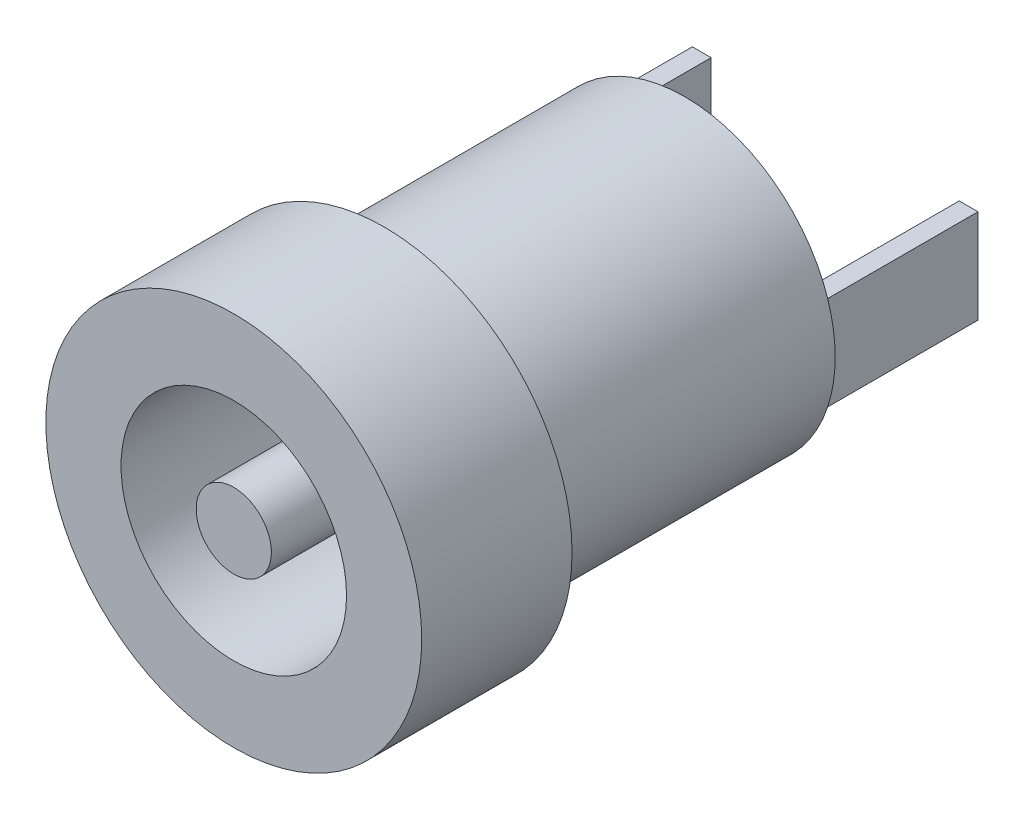
ISO-10303-21;
HEADER;
FILE_DESCRIPTION(('STEP AP214'),'2;1');
FILE_NAME('part.step','',(''),(''),'','','');
FILE_SCHEMA(('AUTOMOTIVE_DESIGN { 1 0 10303 214 1 1 1 1 }'));
ENDSEC;
DATA;
#1=APPLICATION_CONTEXT('core data for automotive mechanical design processes');
#2=APPLICATION_PROTOCOL_DEFINITION('international standard','automotive_design',2000,#1);
#3=PRODUCT_CONTEXT('',#1,'mechanical');
#4=PRODUCT('Part','Part','',(#3));
#5=PRODUCT_RELATED_PRODUCT_CATEGORY('part','',(#4));
#6=PRODUCT_DEFINITION_FORMATION('','',#4);
#7=PRODUCT_DEFINITION_CONTEXT('part definition',#1,'design');
#8=PRODUCT_DEFINITION('design','',#6,#7);
#9=PRODUCT_DEFINITION_SHAPE('','',#8);
#10=(LENGTH_UNIT() NAMED_UNIT(*) SI_UNIT(.MILLI.,.METRE.));
#11=(NAMED_UNIT(*) PLANE_ANGLE_UNIT() SI_UNIT($,.RADIAN.));
#12=(NAMED_UNIT(*) SI_UNIT($,.STERADIAN.) SOLID_ANGLE_UNIT());
#13=UNCERTAINTY_MEASURE_WITH_UNIT(LENGTH_MEASURE(1.E-05),#10,'distance_accuracy_value','');
#14=(GEOMETRIC_REPRESENTATION_CONTEXT(3) GLOBAL_UNCERTAINTY_ASSIGNED_CONTEXT((#13)) GLOBAL_UNIT_ASSIGNED_CONTEXT((#10,
#11,#12)) REPRESENTATION_CONTEXT('',''));
#15=CARTESIAN_POINT('',(0.,0.,0.));
#16=DIRECTION('',(0.,0.,1.));
#17=DIRECTION('',(1.,0.,0.));
#18=AXIS2_PLACEMENT_3D('',#15,#16,#17);
#19=CARTESIAN_POINT('',(0.,0.,-12.));
#20=DIRECTION('',(0.,0.,-1.));
#21=DIRECTION('',(-1.,0.,0.));
#22=AXIS2_PLACEMENT_3D('',#19,#20,#21);
#23=PLANE('',#22);
#24=DIRECTION('',(0.,-1.,0.));
#25=VECTOR('',#24,1.);
#26=CARTESIAN_POINT('',(-3.3,0.,-12.));
#27=LINE('',#26,#25);
#28=CARTESIAN_POINT('',(-3.3,1.24899959967968,-12.));
#29=VERTEX_POINT('',#28);
#30=CARTESIAN_POINT('',(-3.3,-1.24899959967968,-12.));
#31=VERTEX_POINT('',#30);
#32=EDGE_CURVE('E56',#29,#31,#27,.T.);
#33=ORIENTED_EDGE('',*,*,#32,.F.);
#34=DIRECTION('',(1.,0.,0.));
#35=VECTOR('',#34,1.);
#36=CARTESIAN_POINT('',(0.,1.24899959967968,-12.));
#37=LINE('',#36,#35);
#38=CARTESIAN_POINT('',(-3.8,1.24899959967968,-12.));
#39=VERTEX_POINT('',#38);
#40=EDGE_CURVE('E137',#39,#29,#37,.T.);
#41=ORIENTED_EDGE('',*,*,#40,.F.);
#42=CARTESIAN_POINT('',(0.,0.,-12.));
#43=DIRECTION('',(0.,0.,-1.));
#44=DIRECTION('',(-1.,0.,0.));
#45=AXIS2_PLACEMENT_3D('',#42,#43,#44);
#46=CIRCLE('',#45,4.);
#47=CARTESIAN_POINT('',(3.8,1.24899959967968,-12.));
#48=VERTEX_POINT('',#47);
#49=EDGE_CURVE('E179',#39,#48,#46,.T.);
#50=ORIENTED_EDGE('',*,*,#49,.T.);
#51=DIRECTION('',(-1.,0.,0.));
#52=VECTOR('',#51,1.);
#53=CARTESIAN_POINT('',(0.,1.24899959967968,-12.));
#54=LINE('',#53,#52);
#55=CARTESIAN_POINT('',(3.3,1.24899959967968,-12.));
#56=VERTEX_POINT('',#55);
#57=EDGE_CURVE('E158',#48,#56,#54,.T.);
#58=ORIENTED_EDGE('',*,*,#57,.T.);
#59=DIRECTION('',(0.,-1.,0.));
#60=VECTOR('',#59,1.);
#61=CARTESIAN_POINT('',(3.3,0.,-12.));
#62=LINE('',#61,#60);
#63=CARTESIAN_POINT('',(3.3,-1.24899959967968,-12.));
#64=VERTEX_POINT('',#63);
#65=EDGE_CURVE('E116',#56,#64,#62,.T.);
#66=ORIENTED_EDGE('',*,*,#65,.T.);
#67=DIRECTION('',(-1.,0.,0.));
#68=VECTOR('',#67,1.);
#69=CARTESIAN_POINT('',(0.,-1.24899959967968,-12.));
#70=LINE('',#69,#68);
#71=CARTESIAN_POINT('',(3.8,-1.24899959967968,-12.));
#72=VERTEX_POINT('',#71);
#73=EDGE_CURVE('E148',#72,#64,#70,.T.);
#74=ORIENTED_EDGE('',*,*,#73,.F.);
#75=CARTESIAN_POINT('',(-3.8,-1.24899959967968,-12.));
#76=VERTEX_POINT('',#75);
#77=EDGE_CURVE('E186',#72,#76,#46,.T.);
#78=ORIENTED_EDGE('',*,*,#77,.T.);
#79=DIRECTION('',(1.,0.,0.));
#80=VECTOR('',#79,1.);
#81=CARTESIAN_POINT('',(0.,-1.24899959967968,-12.));
#82=LINE('',#81,#80);
#83=EDGE_CURVE('E61',#76,#31,#82,.T.);
#84=ORIENTED_EDGE('',*,*,#83,.T.);
#85=EDGE_LOOP('',(#33,#41,#50,#58,#66,#74,#78,#84));
#86=FACE_BOUND('',#85,.T.);
#87=ADVANCED_FACE('F41',(#86),#23,.T.);
#88=DIRECTION('',(0.,-1.,0.));
#89=VECTOR('',#88,1.);
#90=CARTESIAN_POINT('',(-3.8,0.,-12.));
#91=LINE('',#90,#89);
#92=EDGE_CURVE('E114',#39,#76,#91,.T.);
#93=ORIENTED_EDGE('',*,*,#92,.T.);
#94=EDGE_CURVE('E241',#76,#39,#46,.T.);
#95=ORIENTED_EDGE('',*,*,#94,.T.);
#96=EDGE_LOOP('',(#93,#95));
#97=FACE_BOUND('',#96,.T.);
#98=ADVANCED_FACE('F209',(#97),#23,.T.);
#99=CARTESIAN_POINT('',(0.,0.,-4.));
#100=DIRECTION('',(0.,0.,1.));
#101=DIRECTION('',(1.,0.,0.));
#102=AXIS2_PLACEMENT_3D('',#99,#100,#101);
#103=CYLINDRICAL_SURFACE('',#102,3.);
#104=CARTESIAN_POINT('',(0.,0.,-4.));
#105=DIRECTION('',(0.,0.,1.));
#106=DIRECTION('',(1.,0.,0.));
#107=AXIS2_PLACEMENT_3D('',#104,#105,#106);
#108=CIRCLE('',#107,3.);
#109=CARTESIAN_POINT('',(3.,0.,-4.));
#110=VERTEX_POINT('',#109);
#111=EDGE_CURVE('E187',#110,#110,#108,.T.);
#112=ORIENTED_EDGE('',*,*,#111,.F.);
#113=EDGE_LOOP('',(#112));
#114=FACE_BOUND('',#113,.T.);
#115=CARTESIAN_POINT('',(0.,0.,0.));
#116=DIRECTION('',(0.,0.,1.));
#117=DIRECTION('',(1.,0.,0.));
#118=AXIS2_PLACEMENT_3D('',#115,#116,#117);
#119=CIRCLE('',#118,3.);
#120=CARTESIAN_POINT('',(3.,0.,0.));
#121=VERTEX_POINT('',#120);
#122=EDGE_CURVE('E185',#121,#121,#119,.T.);
#123=ORIENTED_EDGE('',*,*,#122,.T.);
#124=EDGE_LOOP('',(#123));
#125=FACE_BOUND('',#124,.T.);
#126=ADVANCED_FACE('F43',(#114,#125),#103,.F.);
#127=CARTESIAN_POINT('',(0.,0.,-4.));
#128=DIRECTION('',(0.,0.,1.));
#129=DIRECTION('',(1.,0.,0.));
#130=AXIS2_PLACEMENT_3D('',#127,#128,#129);
#131=CYLINDRICAL_SURFACE('',#130,5.);
#132=CARTESIAN_POINT('',(0.,0.,-4.));
#133=DIRECTION('',(0.,0.,1.));
#134=DIRECTION('',(1.,0.,0.));
#135=AXIS2_PLACEMENT_3D('',#132,#133,#134);
#136=CIRCLE('',#135,5.);
#137=CARTESIAN_POINT('',(5.,0.,-4.));
#138=VERTEX_POINT('',#137);
#139=EDGE_CURVE('E49',#138,#138,#136,.T.);
#140=ORIENTED_EDGE('',*,*,#139,.T.);
#141=EDGE_LOOP('',(#140));
#142=FACE_BOUND('',#141,.T.);
#143=CARTESIAN_POINT('',(0.,0.,0.));
#144=DIRECTION('',(0.,0.,1.));
#145=DIRECTION('',(1.,0.,0.));
#146=AXIS2_PLACEMENT_3D('',#143,#144,#145);
#147=CIRCLE('',#146,5.);
#148=CARTESIAN_POINT('',(5.,0.,0.));
#149=VERTEX_POINT('',#148);
#150=EDGE_CURVE('E190',#149,#149,#147,.T.);
#151=ORIENTED_EDGE('',*,*,#150,.F.);
#152=EDGE_LOOP('',(#151));
#153=FACE_BOUND('',#152,.T.);
#154=ADVANCED_FACE('F199',(#142,#153),#131,.T.);
#155=CARTESIAN_POINT('',(0.,0.,-4.));
#156=DIRECTION('',(0.,0.,1.));
#157=DIRECTION('',(1.,0.,0.));
#158=AXIS2_PLACEMENT_3D('',#155,#156,#157);
#159=PLANE('',#158);
#160=CARTESIAN_POINT('',(0.,0.,-4.));
#161=DIRECTION('',(0.,0.,1.));
#162=DIRECTION('',(1.,0.,0.));
#163=AXIS2_PLACEMENT_3D('',#160,#161,#162);
#164=CIRCLE('',#163,4.);
#165=CARTESIAN_POINT('',(4.,0.,-4.));
#166=VERTEX_POINT('',#165);
#167=EDGE_CURVE('E12',#166,#166,#164,.F.);
#168=ORIENTED_EDGE('',*,*,#167,.F.);
#169=EDGE_LOOP('',(#168));
#170=FACE_BOUND('',#169,.T.);
#171=ORIENTED_EDGE('',*,*,#139,.F.);
#172=EDGE_LOOP('',(#171));
#173=FACE_BOUND('',#172,.T.);
#174=ADVANCED_FACE('F201',(#170,#173),#159,.F.);
#175=CARTESIAN_POINT('',(0.,0.,0.));
#176=DIRECTION('',(0.,0.,1.));
#177=DIRECTION('',(1.,0.,0.));
#178=AXIS2_PLACEMENT_3D('',#175,#176,#177);
#179=PLANE('',#178);
#180=ORIENTED_EDGE('',*,*,#122,.F.);
#181=EDGE_LOOP('',(#180));
#182=FACE_BOUND('',#181,.T.);
#183=ORIENTED_EDGE('',*,*,#150,.T.);
#184=EDGE_LOOP('',(#183));
#185=FACE_BOUND('',#184,.T.);
#186=ADVANCED_FACE('F197',(#182,#185),#179,.T.);
#187=DIRECTION('',(0.,-1.,0.));
#188=VECTOR('',#187,1.);
#189=CARTESIAN_POINT('',(3.8,0.,-12.));
#190=LINE('',#189,#188);
#191=EDGE_CURVE('E161',#48,#72,#190,.T.);
#192=ORIENTED_EDGE('',*,*,#191,.F.);
#193=EDGE_CURVE('E182',#48,#72,#46,.T.);
#194=ORIENTED_EDGE('',*,*,#193,.T.);
#195=EDGE_LOOP('',(#192,#194));
#196=FACE_BOUND('',#195,.T.);
#197=ADVANCED_FACE('F214',(#196),#23,.T.);
#198=CARTESIAN_POINT('',(0.,0.,-12.));
#199=DIRECTION('',(0.,0.,1.));
#200=DIRECTION('',(1.,0.,0.));
#201=AXIS2_PLACEMENT_3D('',#198,#199,#200);
#202=CYLINDRICAL_SURFACE('',#201,4.);
#203=ORIENTED_EDGE('',*,*,#193,.F.);
#204=ORIENTED_EDGE('',*,*,#49,.F.);
#205=ORIENTED_EDGE('',*,*,#94,.F.);
#206=ORIENTED_EDGE('',*,*,#77,.F.);
#207=EDGE_LOOP('',(#203,#204,#205,#206));
#208=FACE_BOUND('',#207,.T.);
#209=ORIENTED_EDGE('',*,*,#167,.T.);
#210=EDGE_LOOP('',(#209));
#211=FACE_BOUND('',#210,.T.);
#212=ADVANCED_FACE('F222',(#208,#211),#202,.T.);
#213=CARTESIAN_POINT('',(0.,0.,-4.));
#214=DIRECTION('',(0.,0.,-1.));
#215=DIRECTION('',(-1.,0.,0.));
#216=AXIS2_PLACEMENT_3D('',#213,#214,#215);
#217=PLANE('',#216);
#218=CARTESIAN_POINT('',(0.,0.,-4.));
#219=DIRECTION('',(0.,0.,1.));
#220=DIRECTION('',(1.,0.,0.));
#221=AXIS2_PLACEMENT_3D('',#218,#219,#220);
#222=CIRCLE('',#221,1.);
#223=CARTESIAN_POINT('',(1.,0.,-4.));
#224=VERTEX_POINT('',#223);
#225=EDGE_CURVE('E176',#224,#224,#222,.T.);
#226=ORIENTED_EDGE('',*,*,#225,.F.);
#227=EDGE_LOOP('',(#226));
#228=FACE_BOUND('',#227,.T.);
#229=ORIENTED_EDGE('',*,*,#111,.T.);
#230=EDGE_LOOP('',(#229));
#231=FACE_BOUND('',#230,.T.);
#232=ADVANCED_FACE('F228',(#228,#231),#217,.F.);
#233=CARTESIAN_POINT('',(0.,0.,-4.));
#234=DIRECTION('',(0.,0.,1.));
#235=DIRECTION('',(1.,0.,0.));
#236=AXIS2_PLACEMENT_3D('',#233,#234,#235);
#237=CYLINDRICAL_SURFACE('',#236,1.);
#238=ORIENTED_EDGE('',*,*,#225,.T.);
#239=EDGE_LOOP('',(#238));
#240=FACE_BOUND('',#239,.T.);
#241=CARTESIAN_POINT('',(0.,0.,0.));
#242=DIRECTION('',(0.,0.,1.));
#243=DIRECTION('',(1.,0.,0.));
#244=AXIS2_PLACEMENT_3D('',#241,#242,#243);
#245=CIRCLE('',#244,1.);
#246=CARTESIAN_POINT('',(1.,0.,0.));
#247=VERTEX_POINT('',#246);
#248=EDGE_CURVE('E175',#247,#247,#245,.T.);
#249=ORIENTED_EDGE('',*,*,#248,.F.);
#250=EDGE_LOOP('',(#249));
#251=FACE_BOUND('',#250,.T.);
#252=ADVANCED_FACE('F274',(#240,#251),#237,.T.);
#253=CARTESIAN_POINT('',(0.,0.,0.));
#254=DIRECTION('',(0.,0.,1.));
#255=DIRECTION('',(1.,0.,0.));
#256=AXIS2_PLACEMENT_3D('',#253,#254,#255);
#257=PLANE('',#256);
#258=ORIENTED_EDGE('',*,*,#248,.T.);
#259=EDGE_LOOP('',(#258));
#260=FACE_BOUND('',#259,.T.);
#261=ADVANCED_FACE('F272',(#260),#257,.T.);
#262=CARTESIAN_POINT('',(3.3,0.,-16.));
#263=DIRECTION('',(-1.,0.,0.));
#264=DIRECTION('',(0.,0.,1.));
#265=AXIS2_PLACEMENT_3D('',#262,#263,#264);
#266=PLANE('',#265);
#267=ORIENTED_EDGE('',*,*,#65,.F.);
#268=DIRECTION('',(0.,0.,1.));
#269=VECTOR('',#268,1.);
#270=CARTESIAN_POINT('',(3.3,1.24899959967968,-16.));
#271=LINE('',#270,#269);
#272=CARTESIAN_POINT('',(3.3,1.24899959967968,-16.));
#273=VERTEX_POINT('',#272);
#274=EDGE_CURVE('E172',#273,#56,#271,.T.);
#275=ORIENTED_EDGE('',*,*,#274,.F.);
#276=DIRECTION('',(0.,-1.,0.));
#277=VECTOR('',#276,1.);
#278=CARTESIAN_POINT('',(3.3,0.,-16.));
#279=LINE('',#278,#277);
#280=CARTESIAN_POINT('',(3.3,-1.24899959967968,-16.));
#281=VERTEX_POINT('',#280);
#282=EDGE_CURVE('E144',#273,#281,#279,.T.);
#283=ORIENTED_EDGE('',*,*,#282,.T.);
#284=DIRECTION('',(0.,0.,1.));
#285=VECTOR('',#284,1.);
#286=CARTESIAN_POINT('',(3.3,-1.24899959967968,-16.));
#287=LINE('',#286,#285);
#288=EDGE_CURVE('E155',#281,#64,#287,.T.);
#289=ORIENTED_EDGE('',*,*,#288,.T.);
#290=EDGE_LOOP('',(#267,#275,#283,#289));
#291=FACE_BOUND('',#290,.T.);
#292=ADVANCED_FACE('F251',(#291),#266,.T.);
#293=CARTESIAN_POINT('',(0.,1.24899959967968,-16.));
#294=DIRECTION('',(0.,1.,0.));
#295=DIRECTION('',(0.,0.,1.));
#296=AXIS2_PLACEMENT_3D('',#293,#294,#295);
#297=PLANE('',#296);
#298=ORIENTED_EDGE('',*,*,#57,.F.);
#299=DIRECTION('',(0.,0.,1.));
#300=VECTOR('',#299,1.);
#301=CARTESIAN_POINT('',(3.8,1.24899959967968,-16.));
#302=LINE('',#301,#300);
#303=CARTESIAN_POINT('',(3.8,1.24899959967968,-16.));
#304=VERTEX_POINT('',#303);
#305=EDGE_CURVE('E169',#304,#48,#302,.T.);
#306=ORIENTED_EDGE('',*,*,#305,.F.);
#307=DIRECTION('',(-1.,0.,0.));
#308=VECTOR('',#307,1.);
#309=CARTESIAN_POINT('',(0.,1.24899959967968,-16.));
#310=LINE('',#309,#308);
#311=EDGE_CURVE('E147',#304,#273,#310,.T.);
#312=ORIENTED_EDGE('',*,*,#311,.T.);
#313=ORIENTED_EDGE('',*,*,#274,.T.);
#314=EDGE_LOOP('',(#298,#306,#312,#313));
#315=FACE_BOUND('',#314,.T.);
#316=ADVANCED_FACE('F248',(#315),#297,.T.);
#317=CARTESIAN_POINT('',(3.8,0.,-16.));
#318=DIRECTION('',(-1.,0.,0.));
#319=DIRECTION('',(0.,0.,1.));
#320=AXIS2_PLACEMENT_3D('',#317,#318,#319);
#321=PLANE('',#320);
#322=ORIENTED_EDGE('',*,*,#191,.T.);
#323=DIRECTION('',(0.,0.,1.));
#324=VECTOR('',#323,1.);
#325=CARTESIAN_POINT('',(3.8,-1.24899959967968,-16.));
#326=LINE('',#325,#324);
#327=CARTESIAN_POINT('',(3.8,-1.24899959967968,-16.));
#328=VERTEX_POINT('',#327);
#329=EDGE_CURVE('E166',#328,#72,#326,.T.);
#330=ORIENTED_EDGE('',*,*,#329,.F.);
#331=DIRECTION('',(0.,-1.,0.));
#332=VECTOR('',#331,1.);
#333=CARTESIAN_POINT('',(3.8,0.,-16.));
#334=LINE('',#333,#332);
#335=EDGE_CURVE('E151',#304,#328,#334,.T.);
#336=ORIENTED_EDGE('',*,*,#335,.F.);
#337=ORIENTED_EDGE('',*,*,#305,.T.);
#338=EDGE_LOOP('',(#322,#330,#336,#337));
#339=FACE_BOUND('',#338,.T.);
#340=ADVANCED_FACE('F245',(#339),#321,.F.);
#341=CARTESIAN_POINT('',(0.,-1.24899959967968,-16.));
#342=DIRECTION('',(0.,1.,0.));
#343=DIRECTION('',(0.,0.,1.));
#344=AXIS2_PLACEMENT_3D('',#341,#342,#343);
#345=PLANE('',#344);
#346=ORIENTED_EDGE('',*,*,#73,.T.);
#347=ORIENTED_EDGE('',*,*,#288,.F.);
#348=DIRECTION('',(-1.,0.,0.));
#349=VECTOR('',#348,1.);
#350=CARTESIAN_POINT('',(0.,-1.24899959967968,-16.));
#351=LINE('',#350,#349);
#352=EDGE_CURVE('E153',#328,#281,#351,.T.);
#353=ORIENTED_EDGE('',*,*,#352,.F.);
#354=ORIENTED_EDGE('',*,*,#329,.T.);
#355=EDGE_LOOP('',(#346,#347,#353,#354));
#356=FACE_BOUND('',#355,.T.);
#357=ADVANCED_FACE('F257',(#356),#345,.F.);
#358=CARTESIAN_POINT('',(0.,0.,-16.));
#359=DIRECTION('',(0.,0.,-1.));
#360=DIRECTION('',(-1.,0.,0.));
#361=AXIS2_PLACEMENT_3D('',#358,#359,#360);
#362=PLANE('',#361);
#363=ORIENTED_EDGE('',*,*,#282,.F.);
#364=ORIENTED_EDGE('',*,*,#311,.F.);
#365=ORIENTED_EDGE('',*,*,#335,.T.);
#366=ORIENTED_EDGE('',*,*,#352,.T.);
#367=EDGE_LOOP('',(#363,#364,#365,#366));
#368=FACE_BOUND('',#367,.T.);
#369=ADVANCED_FACE('F253',(#368),#362,.T.);
#370=CARTESIAN_POINT('',(-3.8,0.,-16.));
#371=DIRECTION('',(-1.,0.,0.));
#372=DIRECTION('',(0.,0.,1.));
#373=AXIS2_PLACEMENT_3D('',#370,#371,#372);
#374=PLANE('',#373);
#375=ORIENTED_EDGE('',*,*,#92,.F.);
#376=DIRECTION('',(0.,0.,1.));
#377=VECTOR('',#376,1.);
#378=CARTESIAN_POINT('',(-3.8,1.24899959967968,-16.));
#379=LINE('',#378,#377);
#380=CARTESIAN_POINT('',(-3.8,1.24899959967968,-16.));
#381=VERTEX_POINT('',#380);
#382=EDGE_CURVE('E106',#381,#39,#379,.T.);
#383=ORIENTED_EDGE('',*,*,#382,.F.);
#384=DIRECTION('',(0.,-1.,0.));
#385=VECTOR('',#384,1.);
#386=CARTESIAN_POINT('',(-3.8,0.,-16.));
#387=LINE('',#386,#385);
#388=CARTESIAN_POINT('',(-3.8,-1.24899959967968,-16.));
#389=VERTEX_POINT('',#388);
#390=EDGE_CURVE('E111',#381,#389,#387,.T.);
#391=ORIENTED_EDGE('',*,*,#390,.T.);
#392=DIRECTION('',(0.,0.,1.));
#393=VECTOR('',#392,1.);
#394=CARTESIAN_POINT('',(-3.8,-1.24899959967968,-16.));
#395=LINE('',#394,#393);
#396=EDGE_CURVE('E135',#389,#76,#395,.T.);
#397=ORIENTED_EDGE('',*,*,#396,.T.);
#398=EDGE_LOOP('',(#375,#383,#391,#397));
#399=FACE_BOUND('',#398,.T.);
#400=ADVANCED_FACE('F108',(#399),#374,.T.);
#401=CARTESIAN_POINT('',(0.,1.24899959967968,-16.));
#402=DIRECTION('',(0.,-1.,0.));
#403=DIRECTION('',(0.,0.,-1.));
#404=AXIS2_PLACEMENT_3D('',#401,#402,#403);
#405=PLANE('',#404);
#406=ORIENTED_EDGE('',*,*,#40,.T.);
#407=DIRECTION('',(0.,0.,1.));
#408=VECTOR('',#407,1.);
#409=CARTESIAN_POINT('',(-3.3,1.24899959967968,-16.));
#410=LINE('',#409,#408);
#411=CARTESIAN_POINT('',(-3.3,1.24899959967968,-16.));
#412=VERTEX_POINT('',#411);
#413=EDGE_CURVE('E117',#412,#29,#410,.T.);
#414=ORIENTED_EDGE('',*,*,#413,.F.);
#415=DIRECTION('',(1.,0.,0.));
#416=VECTOR('',#415,1.);
#417=CARTESIAN_POINT('',(0.,1.24899959967968,-16.));
#418=LINE('',#417,#416);
#419=EDGE_CURVE('E120',#381,#412,#418,.T.);
#420=ORIENTED_EDGE('',*,*,#419,.F.);
#421=ORIENTED_EDGE('',*,*,#382,.T.);
#422=EDGE_LOOP('',(#406,#414,#420,#421));
#423=FACE_BOUND('',#422,.T.);
#424=ADVANCED_FACE('F121',(#423),#405,.F.);
#425=CARTESIAN_POINT('',(-3.3,0.,-16.));
#426=DIRECTION('',(-1.,0.,0.));
#427=DIRECTION('',(0.,0.,1.));
#428=AXIS2_PLACEMENT_3D('',#425,#426,#427);
#429=PLANE('',#428);
#430=ORIENTED_EDGE('',*,*,#32,.T.);
#431=DIRECTION('',(0.,0.,1.));
#432=VECTOR('',#431,1.);
#433=CARTESIAN_POINT('',(-3.3,-1.24899959967968,-16.));
#434=LINE('',#433,#432);
#435=CARTESIAN_POINT('',(-3.3,-1.24899959967968,-16.));
#436=VERTEX_POINT('',#435);
#437=EDGE_CURVE('E141',#436,#31,#434,.T.);
#438=ORIENTED_EDGE('',*,*,#437,.F.);
#439=DIRECTION('',(0.,-1.,0.));
#440=VECTOR('',#439,1.);
#441=CARTESIAN_POINT('',(-3.3,0.,-16.));
#442=LINE('',#441,#440);
#443=EDGE_CURVE('E125',#412,#436,#442,.T.);
#444=ORIENTED_EDGE('',*,*,#443,.F.);
#445=ORIENTED_EDGE('',*,*,#413,.T.);
#446=EDGE_LOOP('',(#430,#438,#444,#445));
#447=FACE_BOUND('',#446,.T.);
#448=ADVANCED_FACE('F344',(#447),#429,.F.);
#449=CARTESIAN_POINT('',(0.,-1.24899959967968,-16.));
#450=DIRECTION('',(0.,-1.,0.));
#451=DIRECTION('',(0.,0.,-1.));
#452=AXIS2_PLACEMENT_3D('',#449,#450,#451);
#453=PLANE('',#452);
#454=ORIENTED_EDGE('',*,*,#83,.F.);
#455=ORIENTED_EDGE('',*,*,#396,.F.);
#456=DIRECTION('',(1.,0.,0.));
#457=VECTOR('',#456,1.);
#458=CARTESIAN_POINT('',(0.,-1.24899959967968,-16.));
#459=LINE('',#458,#457);
#460=EDGE_CURVE('E129',#389,#436,#459,.T.);
#461=ORIENTED_EDGE('',*,*,#460,.T.);
#462=ORIENTED_EDGE('',*,*,#437,.T.);
#463=EDGE_LOOP('',(#454,#455,#461,#462));
#464=FACE_BOUND('',#463,.T.);
#465=ADVANCED_FACE('F353',(#464),#453,.T.);
#466=CARTESIAN_POINT('',(0.,0.,-16.));
#467=DIRECTION('',(0.,0.,-1.));
#468=DIRECTION('',(-1.,0.,0.));
#469=AXIS2_PLACEMENT_3D('',#466,#467,#468);
#470=PLANE('',#469);
#471=ORIENTED_EDGE('',*,*,#390,.F.);
#472=ORIENTED_EDGE('',*,*,#419,.T.);
#473=ORIENTED_EDGE('',*,*,#443,.T.);
#474=ORIENTED_EDGE('',*,*,#460,.F.);
#475=EDGE_LOOP('',(#471,#472,#473,#474));
#476=FACE_BOUND('',#475,.T.);
#477=ADVANCED_FACE('F127',(#476),#470,.T.);
#478=CLOSED_SHELL('',(#87,#98,#126,#154,#174,#186,#197,#212,#232,#252,#261,#292,#316,#340,#357,
#369,#400,#424,#448,#465,#477));
#479=MANIFOLD_SOLID_BREP('B2',#478);
#480=ADVANCED_BREP_SHAPE_REPRESENTATION('',(#18,#479),#14);
#481=SHAPE_DEFINITION_REPRESENTATION(#9,#480);
ENDSEC;
END-ISO-10303-21;
